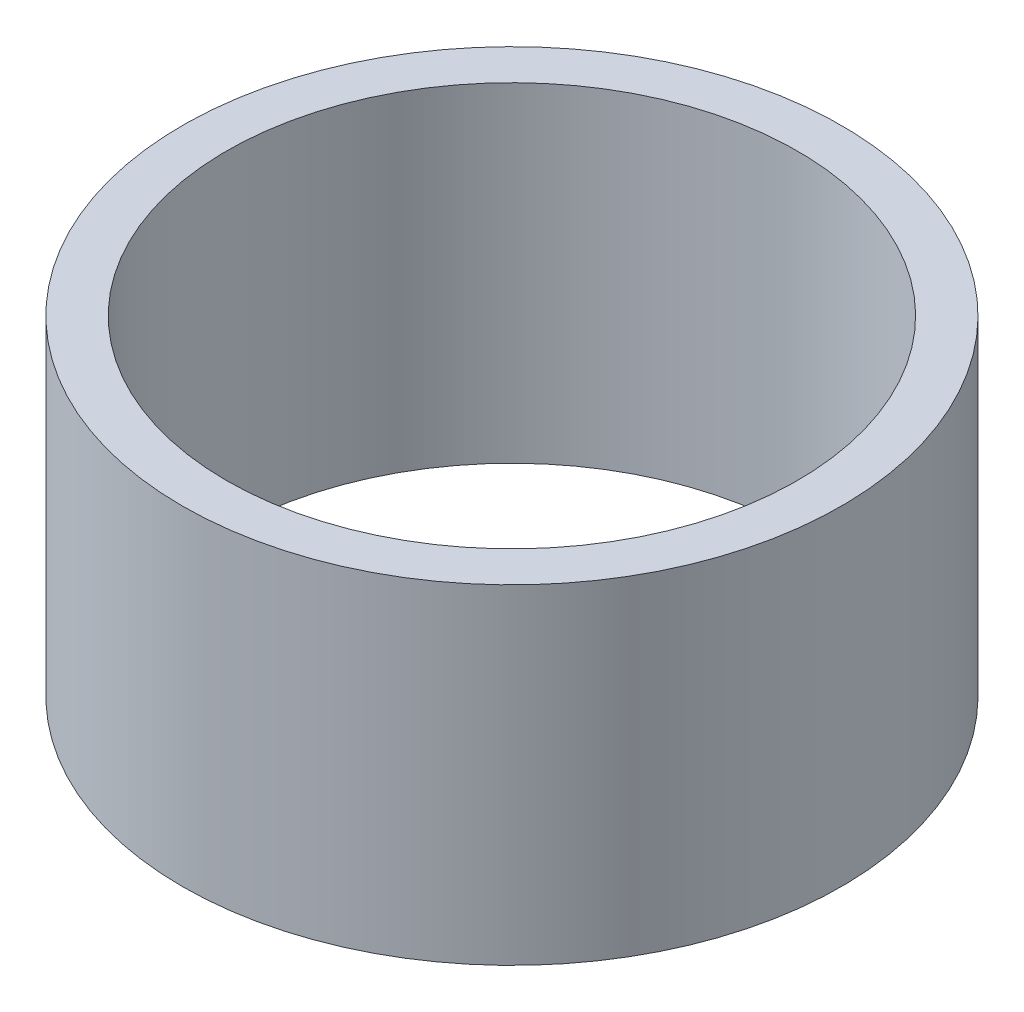
ISO-10303-21;
HEADER;
FILE_DESCRIPTION(('STEP AP214'),'2;1');
FILE_NAME('part.step','',(''),(''),'','','');
FILE_SCHEMA(('AUTOMOTIVE_DESIGN { 1 0 10303 214 1 1 1 1 }'));
ENDSEC;
DATA;
#1=APPLICATION_CONTEXT('core data for automotive mechanical design processes');
#2=APPLICATION_PROTOCOL_DEFINITION('international standard','automotive_design',2000,#1);
#3=PRODUCT_CONTEXT('',#1,'mechanical');
#4=PRODUCT('Part','Part','',(#3));
#5=PRODUCT_RELATED_PRODUCT_CATEGORY('part','',(#4));
#6=PRODUCT_DEFINITION_FORMATION('','',#4);
#7=PRODUCT_DEFINITION_CONTEXT('part definition',#1,'design');
#8=PRODUCT_DEFINITION('design','',#6,#7);
#9=PRODUCT_DEFINITION_SHAPE('','',#8);
#10=(LENGTH_UNIT() NAMED_UNIT(*) SI_UNIT(.MILLI.,.METRE.));
#11=(NAMED_UNIT(*) PLANE_ANGLE_UNIT() SI_UNIT($,.RADIAN.));
#12=(NAMED_UNIT(*) SI_UNIT($,.STERADIAN.) SOLID_ANGLE_UNIT());
#13=UNCERTAINTY_MEASURE_WITH_UNIT(LENGTH_MEASURE(1.E-05),#10,'distance_accuracy_value','');
#14=(GEOMETRIC_REPRESENTATION_CONTEXT(3) GLOBAL_UNCERTAINTY_ASSIGNED_CONTEXT((#13)) GLOBAL_UNIT_ASSIGNED_CONTEXT((#10,
#11,#12)) REPRESENTATION_CONTEXT('',''));
#15=CARTESIAN_POINT('',(0.,0.,0.));
#16=DIRECTION('',(0.,0.,1.));
#17=DIRECTION('',(1.,0.,0.));
#18=AXIS2_PLACEMENT_3D('',#15,#16,#17);
#19=CARTESIAN_POINT('',(0.,12.7,0.));
#20=DIRECTION('',(0.,1.,0.));
#21=DIRECTION('',(0.,0.,1.));
#22=AXIS2_PLACEMENT_3D('',#19,#20,#21);
#23=PLANE('',#22);
#24=CARTESIAN_POINT('',(0.,12.7,0.));
#25=DIRECTION('',(0.,1.,0.));
#26=DIRECTION('',(0.,0.,1.));
#27=AXIS2_PLACEMENT_3D('',#24,#25,#26);
#28=CIRCLE('',#27,12.7);
#29=CARTESIAN_POINT('',(0.,12.7,12.7));
#30=VERTEX_POINT('',#29);
#31=EDGE_CURVE('E10',#30,#30,#28,.T.);
#32=ORIENTED_EDGE('',*,*,#31,.T.);
#33=EDGE_LOOP('',(#32));
#34=FACE_BOUND('',#33,.T.);
#35=CARTESIAN_POINT('',(0.,12.7,0.));
#36=DIRECTION('',(0.,1.,0.));
#37=DIRECTION('',(0.,0.,1.));
#38=AXIS2_PLACEMENT_3D('',#35,#36,#37);
#39=CIRCLE('',#38,11.);
#40=CARTESIAN_POINT('',(0.,12.7,11.));
#41=VERTEX_POINT('',#40);
#42=EDGE_CURVE('E43',#41,#41,#39,.T.);
#43=ORIENTED_EDGE('',*,*,#42,.F.);
#44=EDGE_LOOP('',(#43));
#45=FACE_BOUND('',#44,.T.);
#46=ADVANCED_FACE('F32',(#34,#45),#23,.T.);
#47=CARTESIAN_POINT('',(0.,0.,0.));
#48=DIRECTION('',(0.,1.,0.));
#49=DIRECTION('',(0.,0.,1.));
#50=AXIS2_PLACEMENT_3D('',#47,#48,#49);
#51=PLANE('',#50);
#52=CARTESIAN_POINT('',(0.,0.,0.));
#53=DIRECTION('',(0.,1.,0.));
#54=DIRECTION('',(0.,0.,1.));
#55=AXIS2_PLACEMENT_3D('',#52,#53,#54);
#56=CIRCLE('',#55,12.7);
#57=CARTESIAN_POINT('',(0.,0.,12.7));
#58=VERTEX_POINT('',#57);
#59=EDGE_CURVE('E36',#58,#58,#56,.T.);
#60=ORIENTED_EDGE('',*,*,#59,.F.);
#61=EDGE_LOOP('',(#60));
#62=FACE_BOUND('',#61,.T.);
#63=CARTESIAN_POINT('',(0.,0.,0.));
#64=DIRECTION('',(0.,1.,0.));
#65=DIRECTION('',(0.,0.,1.));
#66=AXIS2_PLACEMENT_3D('',#63,#64,#65);
#67=CIRCLE('',#66,11.);
#68=CARTESIAN_POINT('',(0.,0.,11.));
#69=VERTEX_POINT('',#68);
#70=EDGE_CURVE('E45',#69,#69,#67,.T.);
#71=ORIENTED_EDGE('',*,*,#70,.T.);
#72=EDGE_LOOP('',(#71));
#73=FACE_BOUND('',#72,.T.);
#74=ADVANCED_FACE('F55',(#62,#73),#51,.F.);
#75=CARTESIAN_POINT('',(0.,12.7,0.));
#76=DIRECTION('',(0.,-1.,0.));
#77=DIRECTION('',(0.,0.,-1.));
#78=AXIS2_PLACEMENT_3D('',#75,#76,#77);
#79=CYLINDRICAL_SURFACE('',#78,12.7);
#80=ORIENTED_EDGE('',*,*,#31,.F.);
#81=EDGE_LOOP('',(#80));
#82=FACE_BOUND('',#81,.T.);
#83=ORIENTED_EDGE('',*,*,#59,.T.);
#84=EDGE_LOOP('',(#83));
#85=FACE_BOUND('',#84,.T.);
#86=ADVANCED_FACE('F34',(#82,#85),#79,.T.);
#87=CARTESIAN_POINT('',(0.,12.7,0.));
#88=DIRECTION('',(0.,-1.,0.));
#89=DIRECTION('',(0.,0.,-1.));
#90=AXIS2_PLACEMENT_3D('',#87,#88,#89);
#91=CYLINDRICAL_SURFACE('',#90,11.);
#92=ORIENTED_EDGE('',*,*,#42,.T.);
#93=EDGE_LOOP('',(#92));
#94=FACE_BOUND('',#93,.T.);
#95=ORIENTED_EDGE('',*,*,#70,.F.);
#96=EDGE_LOOP('',(#95));
#97=FACE_BOUND('',#96,.T.);
#98=ADVANCED_FACE('F51',(#94,#97),#91,.F.);
#99=CLOSED_SHELL('',(#46,#74,#86,#98));
#100=MANIFOLD_SOLID_BREP('B2',#99);
#101=ADVANCED_BREP_SHAPE_REPRESENTATION('',(#18,#100),#14);
#102=SHAPE_DEFINITION_REPRESENTATION(#9,#101);
ENDSEC;
END-ISO-10303-21;
